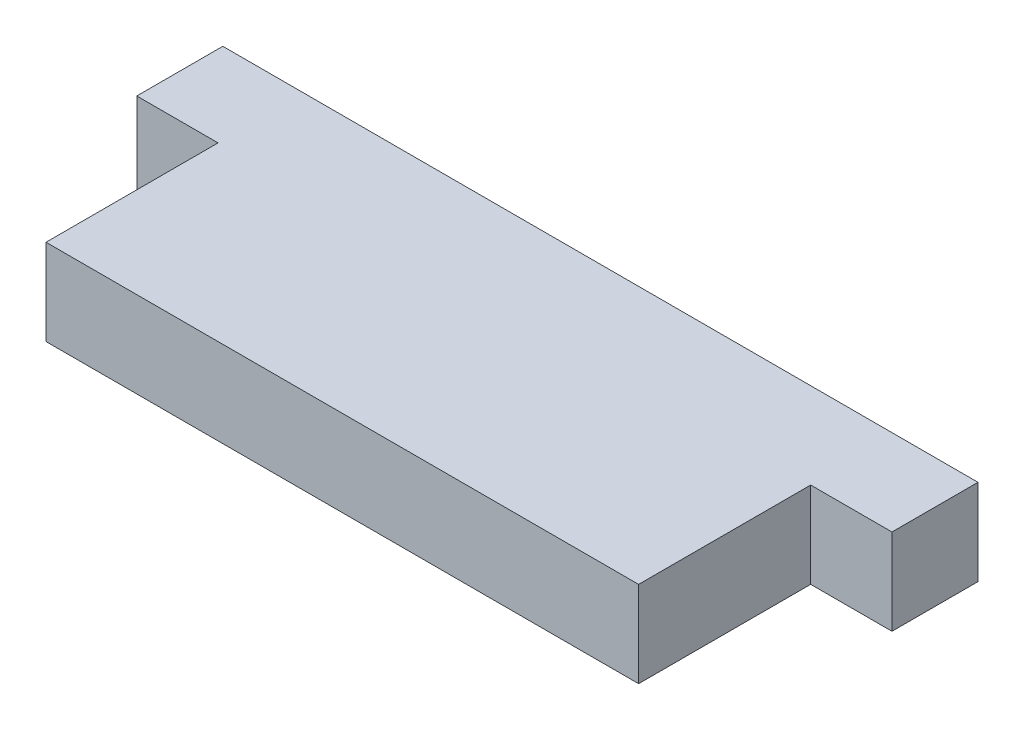
ISO-10303-21;
HEADER;
FILE_DESCRIPTION(('STEP AP214'),'2;1');
FILE_NAME('part.step','',(''),(''),'','','');
FILE_SCHEMA(('AUTOMOTIVE_DESIGN { 1 0 10303 214 1 1 1 1 }'));
ENDSEC;
DATA;
#1=APPLICATION_CONTEXT('core data for automotive mechanical design processes');
#2=APPLICATION_PROTOCOL_DEFINITION('international standard','automotive_design',2000,#1);
#3=PRODUCT_CONTEXT('',#1,'mechanical');
#4=PRODUCT('Part','Part','',(#3));
#5=PRODUCT_RELATED_PRODUCT_CATEGORY('part','',(#4));
#6=PRODUCT_DEFINITION_FORMATION('','',#4);
#7=PRODUCT_DEFINITION_CONTEXT('part definition',#1,'design');
#8=PRODUCT_DEFINITION('design','',#6,#7);
#9=PRODUCT_DEFINITION_SHAPE('','',#8);
#10=(LENGTH_UNIT() NAMED_UNIT(*) SI_UNIT(.MILLI.,.METRE.));
#11=(NAMED_UNIT(*) PLANE_ANGLE_UNIT() SI_UNIT($,.RADIAN.));
#12=(NAMED_UNIT(*) SI_UNIT($,.STERADIAN.) SOLID_ANGLE_UNIT());
#13=UNCERTAINTY_MEASURE_WITH_UNIT(LENGTH_MEASURE(1.E-05),#10,'distance_accuracy_value','');
#14=(GEOMETRIC_REPRESENTATION_CONTEXT(3) GLOBAL_UNCERTAINTY_ASSIGNED_CONTEXT((#13)) GLOBAL_UNIT_ASSIGNED_CONTEXT((#10,
#11,#12)) REPRESENTATION_CONTEXT('',''));
#15=CARTESIAN_POINT('',(0.,0.,0.));
#16=DIRECTION('',(0.,0.,1.));
#17=DIRECTION('',(1.,0.,0.));
#18=AXIS2_PLACEMENT_3D('',#15,#16,#17);
#19=CARTESIAN_POINT('',(0.,6.35,0.));
#20=DIRECTION('',(0.,0.,-1.));
#21=DIRECTION('',(-1.,0.,0.));
#22=AXIS2_PLACEMENT_3D('',#19,#20,#21);
#23=PLANE('',#22);
#24=DIRECTION('',(1.,0.,0.));
#25=VECTOR('',#24,1.);
#26=CARTESIAN_POINT('',(0.,0.,0.));
#27=LINE('',#26,#25);
#28=CARTESIAN_POINT('',(0.,0.,0.));
#29=VERTEX_POINT('',#28);
#30=CARTESIAN_POINT('',(43.739999896,0.,0.));
#31=VERTEX_POINT('',#30);
#32=EDGE_CURVE('E129',#29,#31,#27,.T.);
#33=ORIENTED_EDGE('',*,*,#32,.T.);
#34=DIRECTION('',(0.,-1.,0.));
#35=VECTOR('',#34,1.);
#36=CARTESIAN_POINT('',(43.739999896,6.35,0.));
#37=LINE('',#36,#35);
#38=CARTESIAN_POINT('',(43.739999896,6.35,0.));
#39=VERTEX_POINT('',#38);
#40=EDGE_CURVE('E11',#39,#31,#37,.T.);
#41=ORIENTED_EDGE('',*,*,#40,.F.);
#42=DIRECTION('',(1.,0.,0.));
#43=VECTOR('',#42,1.);
#44=CARTESIAN_POINT('',(0.,6.35,0.));
#45=LINE('',#44,#43);
#46=CARTESIAN_POINT('',(0.,6.35,0.));
#47=VERTEX_POINT('',#46);
#48=EDGE_CURVE('E143',#47,#39,#45,.T.);
#49=ORIENTED_EDGE('',*,*,#48,.F.);
#50=DIRECTION('',(0.,-1.,0.));
#51=VECTOR('',#50,1.);
#52=CARTESIAN_POINT('',(0.,6.35,0.));
#53=LINE('',#52,#51);
#54=EDGE_CURVE('E125',#47,#29,#53,.T.);
#55=ORIENTED_EDGE('',*,*,#54,.T.);
#56=EDGE_LOOP('',(#33,#41,#49,#55));
#57=FACE_BOUND('',#56,.T.);
#58=ADVANCED_FACE('F33',(#57),#23,.F.);
#59=CARTESIAN_POINT('',(43.739999896,6.35,0.));
#60=DIRECTION('',(-1.,0.,0.));
#61=DIRECTION('',(0.,0.,1.));
#62=AXIS2_PLACEMENT_3D('',#59,#60,#61);
#63=PLANE('',#62);
#64=DIRECTION('',(0.,0.,-1.));
#65=VECTOR('',#64,1.);
#66=CARTESIAN_POINT('',(43.739999896,0.,0.));
#67=LINE('',#66,#65);
#68=CARTESIAN_POINT('',(43.739999896,0.,-12.7));
#69=VERTEX_POINT('',#68);
#70=EDGE_CURVE('E132',#31,#69,#67,.T.);
#71=ORIENTED_EDGE('',*,*,#70,.T.);
#72=DIRECTION('',(0.,-1.,0.));
#73=VECTOR('',#72,1.);
#74=CARTESIAN_POINT('',(43.739999896,6.35,-12.7));
#75=LINE('',#74,#73);
#76=CARTESIAN_POINT('',(43.739999896,6.35,-12.7));
#77=VERTEX_POINT('',#76);
#78=EDGE_CURVE('E41',#77,#69,#75,.T.);
#79=ORIENTED_EDGE('',*,*,#78,.F.);
#80=DIRECTION('',(0.,0.,-1.));
#81=VECTOR('',#80,1.);
#82=CARTESIAN_POINT('',(43.739999896,6.35,0.));
#83=LINE('',#82,#81);
#84=EDGE_CURVE('E92',#39,#77,#83,.T.);
#85=ORIENTED_EDGE('',*,*,#84,.F.);
#86=ORIENTED_EDGE('',*,*,#40,.T.);
#87=EDGE_LOOP('',(#71,#79,#85,#86));
#88=FACE_BOUND('',#87,.T.);
#89=ADVANCED_FACE('F178',(#88),#63,.F.);
#90=CARTESIAN_POINT('',(43.739999896,6.35,-12.7));
#91=DIRECTION('',(0.,0.,-1.));
#92=DIRECTION('',(-1.,0.,0.));
#93=AXIS2_PLACEMENT_3D('',#90,#91,#92);
#94=PLANE('',#93);
#95=DIRECTION('',(1.,0.,0.));
#96=VECTOR('',#95,1.);
#97=CARTESIAN_POINT('',(43.739999896,0.,-12.7));
#98=LINE('',#97,#96);
#99=CARTESIAN_POINT('',(49.739999834,0.,-12.7));
#100=VERTEX_POINT('',#99);
#101=EDGE_CURVE('E134',#69,#100,#98,.T.);
#102=ORIENTED_EDGE('',*,*,#101,.T.);
#103=DIRECTION('',(0.,-1.,0.));
#104=VECTOR('',#103,1.);
#105=CARTESIAN_POINT('',(49.739999834,6.35,-12.7));
#106=LINE('',#105,#104);
#107=CARTESIAN_POINT('',(49.739999834,6.35,-12.7));
#108=VERTEX_POINT('',#107);
#109=EDGE_CURVE('E150',#108,#100,#106,.T.);
#110=ORIENTED_EDGE('',*,*,#109,.F.);
#111=DIRECTION('',(1.,0.,0.));
#112=VECTOR('',#111,1.);
#113=CARTESIAN_POINT('',(43.739999896,6.35,-12.7));
#114=LINE('',#113,#112);
#115=EDGE_CURVE('E158',#77,#108,#114,.T.);
#116=ORIENTED_EDGE('',*,*,#115,.F.);
#117=ORIENTED_EDGE('',*,*,#78,.T.);
#118=EDGE_LOOP('',(#102,#110,#116,#117));
#119=FACE_BOUND('',#118,.T.);
#120=ADVANCED_FACE('F156',(#119),#94,.F.);
#121=CARTESIAN_POINT('',(49.739999834,6.35,-19.05));
#122=DIRECTION('',(-1.,0.,0.));
#123=DIRECTION('',(0.,0.,1.));
#124=AXIS2_PLACEMENT_3D('',#121,#122,#123);
#125=PLANE('',#124);
#126=DIRECTION('',(0.,0.,-1.));
#127=VECTOR('',#126,1.);
#128=CARTESIAN_POINT('',(49.739999834,0.,-19.05));
#129=LINE('',#128,#127);
#130=CARTESIAN_POINT('',(49.739999834,0.,-19.05));
#131=VERTEX_POINT('',#130);
#132=EDGE_CURVE('E136',#100,#131,#129,.T.);
#133=ORIENTED_EDGE('',*,*,#132,.T.);
#134=DIRECTION('',(0.,-1.,0.));
#135=VECTOR('',#134,1.);
#136=CARTESIAN_POINT('',(49.739999834,6.35,-19.05));
#137=LINE('',#136,#135);
#138=CARTESIAN_POINT('',(49.739999834,6.35,-19.05));
#139=VERTEX_POINT('',#138);
#140=EDGE_CURVE('E147',#139,#131,#137,.T.);
#141=ORIENTED_EDGE('',*,*,#140,.F.);
#142=DIRECTION('',(0.,0.,-1.));
#143=VECTOR('',#142,1.);
#144=CARTESIAN_POINT('',(49.739999834,6.35,-19.05));
#145=LINE('',#144,#143);
#146=EDGE_CURVE('E170',#108,#139,#145,.T.);
#147=ORIENTED_EDGE('',*,*,#146,.F.);
#148=ORIENTED_EDGE('',*,*,#109,.T.);
#149=EDGE_LOOP('',(#133,#141,#147,#148));
#150=FACE_BOUND('',#149,.T.);
#151=ADVANCED_FACE('F166',(#150),#125,.F.);
#152=CARTESIAN_POINT('',(-5.999999938,6.35,-19.05));
#153=DIRECTION('',(0.,0.,1.));
#154=DIRECTION('',(1.,0.,0.));
#155=AXIS2_PLACEMENT_3D('',#152,#153,#154);
#156=PLANE('',#155);
#157=DIRECTION('',(-1.,0.,0.));
#158=VECTOR('',#157,1.);
#159=CARTESIAN_POINT('',(-5.999999938,0.,-19.05));
#160=LINE('',#159,#158);
#161=CARTESIAN_POINT('',(-5.999999938,0.,-19.05));
#162=VERTEX_POINT('',#161);
#163=EDGE_CURVE('E138',#131,#162,#160,.T.);
#164=ORIENTED_EDGE('',*,*,#163,.T.);
#165=DIRECTION('',(0.,-1.,0.));
#166=VECTOR('',#165,1.);
#167=CARTESIAN_POINT('',(-5.999999938,6.35,-19.05));
#168=LINE('',#167,#166);
#169=CARTESIAN_POINT('',(-5.999999938,6.35,-19.05));
#170=VERTEX_POINT('',#169);
#171=EDGE_CURVE('E120',#170,#162,#168,.T.);
#172=ORIENTED_EDGE('',*,*,#171,.F.);
#173=DIRECTION('',(-1.,0.,0.));
#174=VECTOR('',#173,1.);
#175=CARTESIAN_POINT('',(-5.999999938,6.35,-19.05));
#176=LINE('',#175,#174);
#177=EDGE_CURVE('E111',#139,#170,#176,.T.);
#178=ORIENTED_EDGE('',*,*,#177,.F.);
#179=ORIENTED_EDGE('',*,*,#140,.T.);
#180=EDGE_LOOP('',(#164,#172,#178,#179));
#181=FACE_BOUND('',#180,.T.);
#182=ADVANCED_FACE('F169',(#181),#156,.F.);
#183=CARTESIAN_POINT('',(-5.999999938,6.35,-19.05));
#184=DIRECTION('',(1.,0.,0.));
#185=DIRECTION('',(0.,0.,-1.));
#186=AXIS2_PLACEMENT_3D('',#183,#184,#185);
#187=PLANE('',#186);
#188=DIRECTION('',(0.,0.,1.));
#189=VECTOR('',#188,1.);
#190=CARTESIAN_POINT('',(-5.999999938,0.,-19.05));
#191=LINE('',#190,#189);
#192=CARTESIAN_POINT('',(-5.999999938,0.,-12.7));
#193=VERTEX_POINT('',#192);
#194=EDGE_CURVE('E119',#162,#193,#191,.T.);
#195=ORIENTED_EDGE('',*,*,#194,.T.);
#196=DIRECTION('',(0.,-1.,0.));
#197=VECTOR('',#196,1.);
#198=CARTESIAN_POINT('',(-5.999999938,6.35,-12.7));
#199=LINE('',#198,#197);
#200=CARTESIAN_POINT('',(-5.999999938,6.35,-12.7));
#201=VERTEX_POINT('',#200);
#202=EDGE_CURVE('E116',#201,#193,#199,.T.);
#203=ORIENTED_EDGE('',*,*,#202,.F.);
#204=DIRECTION('',(0.,0.,1.));
#205=VECTOR('',#204,1.);
#206=CARTESIAN_POINT('',(-5.999999938,6.35,-19.05));
#207=LINE('',#206,#205);
#208=EDGE_CURVE('E105',#170,#201,#207,.T.);
#209=ORIENTED_EDGE('',*,*,#208,.F.);
#210=ORIENTED_EDGE('',*,*,#171,.T.);
#211=EDGE_LOOP('',(#195,#203,#209,#210));
#212=FACE_BOUND('',#211,.T.);
#213=ADVANCED_FACE('F117',(#212),#187,.F.);
#214=CARTESIAN_POINT('',(-5.999999938,6.35,-12.7));
#215=DIRECTION('',(0.,0.,-1.));
#216=DIRECTION('',(-1.,0.,0.));
#217=AXIS2_PLACEMENT_3D('',#214,#215,#216);
#218=PLANE('',#217);
#219=DIRECTION('',(1.,0.,0.));
#220=VECTOR('',#219,1.);
#221=CARTESIAN_POINT('',(-5.999999938,0.,-12.7));
#222=LINE('',#221,#220);
#223=CARTESIAN_POINT('',(0.,0.,-12.7));
#224=VERTEX_POINT('',#223);
#225=EDGE_CURVE('E78',#193,#224,#222,.T.);
#226=ORIENTED_EDGE('',*,*,#225,.T.);
#227=DIRECTION('',(0.,-1.,0.));
#228=VECTOR('',#227,1.);
#229=CARTESIAN_POINT('',(0.,6.35,-12.7));
#230=LINE('',#229,#228);
#231=CARTESIAN_POINT('',(0.,6.35,-12.7));
#232=VERTEX_POINT('',#231);
#233=EDGE_CURVE('E121',#232,#224,#230,.T.);
#234=ORIENTED_EDGE('',*,*,#233,.F.);
#235=DIRECTION('',(1.,0.,0.));
#236=VECTOR('',#235,1.);
#237=CARTESIAN_POINT('',(-5.999999938,6.35,-12.7));
#238=LINE('',#237,#236);
#239=EDGE_CURVE('E109',#201,#232,#238,.T.);
#240=ORIENTED_EDGE('',*,*,#239,.F.);
#241=ORIENTED_EDGE('',*,*,#202,.T.);
#242=EDGE_LOOP('',(#226,#234,#240,#241));
#243=FACE_BOUND('',#242,.T.);
#244=ADVANCED_FACE('F123',(#243),#218,.F.);
#245=CARTESIAN_POINT('',(0.,6.35,0.));
#246=DIRECTION('',(1.,0.,0.));
#247=DIRECTION('',(0.,0.,-1.));
#248=AXIS2_PLACEMENT_3D('',#245,#246,#247);
#249=PLANE('',#248);
#250=DIRECTION('',(0.,0.,1.));
#251=VECTOR('',#250,1.);
#252=CARTESIAN_POINT('',(0.,0.,0.));
#253=LINE('',#252,#251);
#254=EDGE_CURVE('E84',#224,#29,#253,.T.);
#255=ORIENTED_EDGE('',*,*,#254,.T.);
#256=ORIENTED_EDGE('',*,*,#54,.F.);
#257=DIRECTION('',(0.,0.,1.));
#258=VECTOR('',#257,1.);
#259=CARTESIAN_POINT('',(0.,6.35,0.));
#260=LINE('',#259,#258);
#261=EDGE_CURVE('E49',#232,#47,#260,.T.);
#262=ORIENTED_EDGE('',*,*,#261,.F.);
#263=ORIENTED_EDGE('',*,*,#233,.T.);
#264=EDGE_LOOP('',(#255,#256,#262,#263));
#265=FACE_BOUND('',#264,.T.);
#266=ADVANCED_FACE('F194',(#265),#249,.F.);
#267=CARTESIAN_POINT('',(0.,6.35,0.));
#268=DIRECTION('',(0.,1.,0.));
#269=DIRECTION('',(0.,0.,1.));
#270=AXIS2_PLACEMENT_3D('',#267,#268,#269);
#271=PLANE('',#270);
#272=ORIENTED_EDGE('',*,*,#48,.T.);
#273=ORIENTED_EDGE('',*,*,#84,.T.);
#274=ORIENTED_EDGE('',*,*,#115,.T.);
#275=ORIENTED_EDGE('',*,*,#146,.T.);
#276=ORIENTED_EDGE('',*,*,#177,.T.);
#277=ORIENTED_EDGE('',*,*,#208,.T.);
#278=ORIENTED_EDGE('',*,*,#239,.T.);
#279=ORIENTED_EDGE('',*,*,#261,.T.);
#280=EDGE_LOOP('',(#272,#273,#274,#275,#276,#277,#278,#279));
#281=FACE_BOUND('',#280,.T.);
#282=ADVANCED_FACE('F107',(#281),#271,.T.);
#283=CARTESIAN_POINT('',(0.,0.,0.));
#284=DIRECTION('',(0.,1.,0.));
#285=DIRECTION('',(0.,0.,1.));
#286=AXIS2_PLACEMENT_3D('',#283,#284,#285);
#287=PLANE('',#286);
#288=ORIENTED_EDGE('',*,*,#32,.F.);
#289=ORIENTED_EDGE('',*,*,#254,.F.);
#290=ORIENTED_EDGE('',*,*,#225,.F.);
#291=ORIENTED_EDGE('',*,*,#194,.F.);
#292=ORIENTED_EDGE('',*,*,#163,.F.);
#293=ORIENTED_EDGE('',*,*,#132,.F.);
#294=ORIENTED_EDGE('',*,*,#101,.F.);
#295=ORIENTED_EDGE('',*,*,#70,.F.);
#296=EDGE_LOOP('',(#288,#289,#290,#291,#292,#293,#294,#295));
#297=FACE_BOUND('',#296,.T.);
#298=ADVANCED_FACE('F162',(#297),#287,.F.);
#299=CLOSED_SHELL('',(#58,#89,#120,#151,#182,#213,#244,#266,#282,#298));
#300=MANIFOLD_SOLID_BREP('B2',#299);
#301=ADVANCED_BREP_SHAPE_REPRESENTATION('',(#18,#300),#14);
#302=SHAPE_DEFINITION_REPRESENTATION(#9,#301);
ENDSEC;
END-ISO-10303-21;
